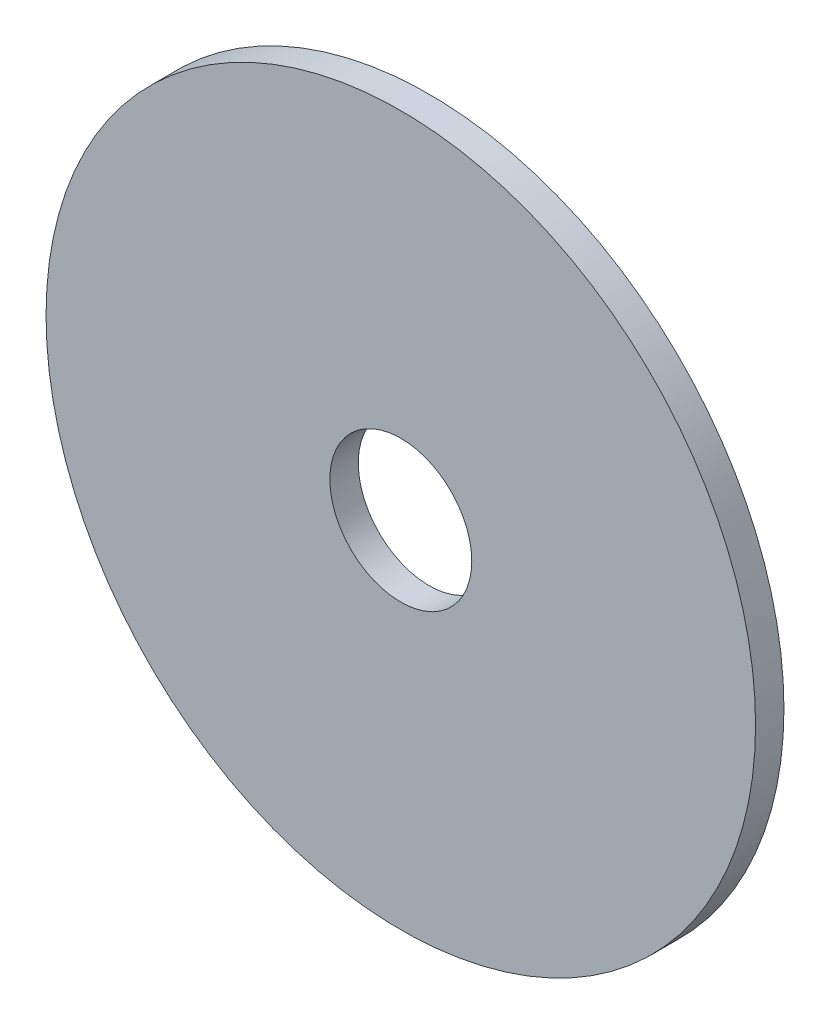
ISO-10303-21;
HEADER;
FILE_DESCRIPTION(('STEP AP214'),'2;1');
FILE_NAME('part.step','',(''),(''),'','','');
FILE_SCHEMA(('AUTOMOTIVE_DESIGN { 1 0 10303 214 1 1 1 1 }'));
ENDSEC;
DATA;
#1=APPLICATION_CONTEXT('core data for automotive mechanical design processes');
#2=APPLICATION_PROTOCOL_DEFINITION('international standard','automotive_design',2000,#1);
#3=PRODUCT_CONTEXT('',#1,'mechanical');
#4=PRODUCT('Part','Part','',(#3));
#5=PRODUCT_RELATED_PRODUCT_CATEGORY('part','',(#4));
#6=PRODUCT_DEFINITION_FORMATION('','',#4);
#7=PRODUCT_DEFINITION_CONTEXT('part definition',#1,'design');
#8=PRODUCT_DEFINITION('design','',#6,#7);
#9=PRODUCT_DEFINITION_SHAPE('','',#8);
#10=(LENGTH_UNIT() NAMED_UNIT(*) SI_UNIT(.MILLI.,.METRE.));
#11=(NAMED_UNIT(*) PLANE_ANGLE_UNIT() SI_UNIT($,.RADIAN.));
#12=(NAMED_UNIT(*) SI_UNIT($,.STERADIAN.) SOLID_ANGLE_UNIT());
#13=UNCERTAINTY_MEASURE_WITH_UNIT(LENGTH_MEASURE(1.E-05),#10,'distance_accuracy_value','');
#14=(GEOMETRIC_REPRESENTATION_CONTEXT(3) GLOBAL_UNCERTAINTY_ASSIGNED_CONTEXT((#13)) GLOBAL_UNIT_ASSIGNED_CONTEXT((#10,
#11,#12)) REPRESENTATION_CONTEXT('',''));
#15=CARTESIAN_POINT('',(0.,0.,0.));
#16=DIRECTION('',(0.,0.,1.));
#17=DIRECTION('',(1.,0.,0.));
#18=AXIS2_PLACEMENT_3D('',#15,#16,#17);
#19=CARTESIAN_POINT('',(0.,0.,-0.635));
#20=DIRECTION('',(0.,0.,-1.));
#21=DIRECTION('',(1.,0.,0.));
#22=AXIS2_PLACEMENT_3D('',#19,#20,#21);
#23=PLANE('',#22);
#24=CARTESIAN_POINT('',(0.,0.,-0.635));
#25=DIRECTION('',(0.,0.,1.));
#26=DIRECTION('',(1.,0.,0.));
#27=AXIS2_PLACEMENT_3D('',#24,#25,#26);
#28=CIRCLE('',#27,7.9375);
#29=CARTESIAN_POINT('',(7.9375,0.,-0.635));
#30=VERTEX_POINT('',#29);
#31=EDGE_CURVE('E10',#30,#30,#28,.T.);
#32=ORIENTED_EDGE('',*,*,#31,.F.);
#33=EDGE_LOOP('',(#32));
#34=FACE_BOUND('',#33,.T.);
#35=CARTESIAN_POINT('',(0.,0.,-0.635));
#36=DIRECTION('',(0.,0.,1.));
#37=DIRECTION('',(1.,0.,0.));
#38=AXIS2_PLACEMENT_3D('',#35,#36,#37);
#39=CIRCLE('',#38,1.5875);
#40=CARTESIAN_POINT('',(1.5875,0.,-0.635));
#41=VERTEX_POINT('',#40);
#42=EDGE_CURVE('E41',#41,#41,#39,.T.);
#43=ORIENTED_EDGE('',*,*,#42,.T.);
#44=EDGE_LOOP('',(#43));
#45=FACE_BOUND('',#44,.T.);
#46=ADVANCED_FACE('F30',(#34,#45),#23,.T.);
#47=CARTESIAN_POINT('',(0.,0.,0.));
#48=DIRECTION('',(0.,0.,-1.));
#49=DIRECTION('',(1.,0.,0.));
#50=AXIS2_PLACEMENT_3D('',#47,#48,#49);
#51=PLANE('',#50);
#52=CARTESIAN_POINT('',(0.,0.,0.));
#53=DIRECTION('',(0.,0.,1.));
#54=DIRECTION('',(1.,0.,0.));
#55=AXIS2_PLACEMENT_3D('',#52,#53,#54);
#56=CIRCLE('',#55,7.9375);
#57=CARTESIAN_POINT('',(7.9375,0.,0.));
#58=VERTEX_POINT('',#57);
#59=EDGE_CURVE('E34',#58,#58,#56,.T.);
#60=ORIENTED_EDGE('',*,*,#59,.T.);
#61=EDGE_LOOP('',(#60));
#62=FACE_BOUND('',#61,.T.);
#63=CARTESIAN_POINT('',(0.,0.,0.));
#64=DIRECTION('',(0.,0.,1.));
#65=DIRECTION('',(1.,0.,0.));
#66=AXIS2_PLACEMENT_3D('',#63,#64,#65);
#67=CIRCLE('',#66,1.5875);
#68=CARTESIAN_POINT('',(1.5875,0.,0.));
#69=VERTEX_POINT('',#68);
#70=EDGE_CURVE('E43',#69,#69,#67,.T.);
#71=ORIENTED_EDGE('',*,*,#70,.F.);
#72=EDGE_LOOP('',(#71));
#73=FACE_BOUND('',#72,.T.);
#74=ADVANCED_FACE('F56',(#62,#73),#51,.F.);
#75=CARTESIAN_POINT('',(0.,0.,-0.635));
#76=DIRECTION('',(0.,0.,1.));
#77=DIRECTION('',(-1.,0.,0.));
#78=AXIS2_PLACEMENT_3D('',#75,#76,#77);
#79=CYLINDRICAL_SURFACE('',#78,7.9375);
#80=ORIENTED_EDGE('',*,*,#31,.T.);
#81=EDGE_LOOP('',(#80));
#82=FACE_BOUND('',#81,.T.);
#83=ORIENTED_EDGE('',*,*,#59,.F.);
#84=EDGE_LOOP('',(#83));
#85=FACE_BOUND('',#84,.T.);
#86=ADVANCED_FACE('F32',(#82,#85),#79,.T.);
#87=CARTESIAN_POINT('',(0.,0.,-0.635));
#88=DIRECTION('',(0.,0.,1.));
#89=DIRECTION('',(-1.,0.,0.));
#90=AXIS2_PLACEMENT_3D('',#87,#88,#89);
#91=CYLINDRICAL_SURFACE('',#90,1.5875);
#92=ORIENTED_EDGE('',*,*,#42,.F.);
#93=EDGE_LOOP('',(#92));
#94=FACE_BOUND('',#93,.T.);
#95=ORIENTED_EDGE('',*,*,#70,.T.);
#96=EDGE_LOOP('',(#95));
#97=FACE_BOUND('',#96,.T.);
#98=ADVANCED_FACE('F50',(#94,#97),#91,.F.);
#99=CLOSED_SHELL('',(#46,#74,#86,#98));
#100=MANIFOLD_SOLID_BREP('B2',#99);
#101=ADVANCED_BREP_SHAPE_REPRESENTATION('',(#18,#100),#14);
#102=SHAPE_DEFINITION_REPRESENTATION(#9,#101);
ENDSEC;
END-ISO-10303-21;
